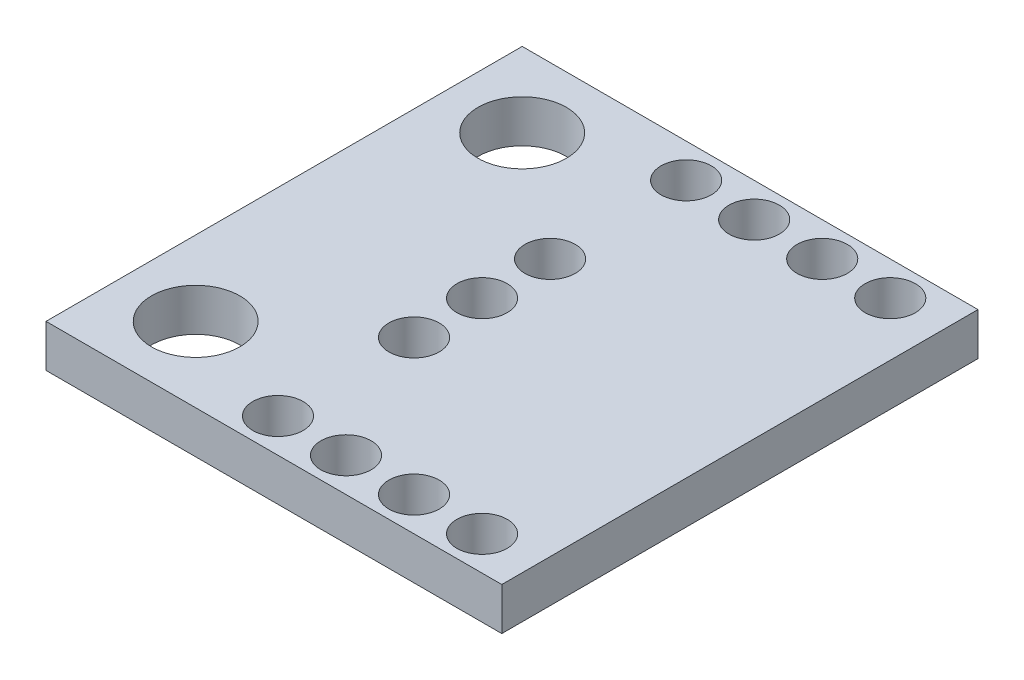
ISO-10303-21;
HEADER;
FILE_DESCRIPTION(('STEP AP214'),'2;1');
FILE_NAME('part.step','',(''),(''),'','','');
FILE_SCHEMA(('AUTOMOTIVE_DESIGN { 1 0 10303 214 1 1 1 1 }'));
ENDSEC;
DATA;
#1=APPLICATION_CONTEXT('core data for automotive mechanical design processes');
#2=APPLICATION_PROTOCOL_DEFINITION('international standard','automotive_design',2000,#1);
#3=PRODUCT_CONTEXT('',#1,'mechanical');
#4=PRODUCT('Part','Part','',(#3));
#5=PRODUCT_RELATED_PRODUCT_CATEGORY('part','',(#4));
#6=PRODUCT_DEFINITION_FORMATION('','',#4);
#7=PRODUCT_DEFINITION_CONTEXT('part definition',#1,'design');
#8=PRODUCT_DEFINITION('design','',#6,#7);
#9=PRODUCT_DEFINITION_SHAPE('','',#8);
#10=(LENGTH_UNIT() NAMED_UNIT(*) SI_UNIT(.MILLI.,.METRE.));
#11=(NAMED_UNIT(*) PLANE_ANGLE_UNIT() SI_UNIT($,.RADIAN.));
#12=(NAMED_UNIT(*) SI_UNIT($,.STERADIAN.) SOLID_ANGLE_UNIT());
#13=UNCERTAINTY_MEASURE_WITH_UNIT(LENGTH_MEASURE(1.E-05),#10,'distance_accuracy_value','');
#14=(GEOMETRIC_REPRESENTATION_CONTEXT(3) GLOBAL_UNCERTAINTY_ASSIGNED_CONTEXT((#13)) GLOBAL_UNIT_ASSIGNED_CONTEXT((#10,
#11,#12)) REPRESENTATION_CONTEXT('',''));
#15=CARTESIAN_POINT('',(0.,0.,0.));
#16=DIRECTION('',(0.,0.,1.));
#17=DIRECTION('',(1.,0.,0.));
#18=AXIS2_PLACEMENT_3D('',#15,#16,#17);
#19=CARTESIAN_POINT('',(0.,-2.2325,0.));
#20=DIRECTION('',(0.,-1.,0.));
#21=DIRECTION('',(0.,0.,-1.));
#22=AXIS2_PLACEMENT_3D('',#19,#20,#21);
#23=PLANE('',#22);
#24=DIRECTION('',(0.,0.,-1.));
#25=VECTOR('',#24,1.);
#26=CARTESIAN_POINT('',(8.50900000000003,-2.2325,71.4879559526874));
#27=LINE('',#26,#25);
#28=CARTESIAN_POINT('',(8.50900000000003,-2.2325,71.4879559526874));
#29=VERTEX_POINT('',#28);
#30=CARTESIAN_POINT('',(8.50900000000003,-2.2325,53.7079559526874));
#31=VERTEX_POINT('',#30);
#32=EDGE_CURVE('E85',#29,#31,#27,.T.);
#33=ORIENTED_EDGE('',*,*,#32,.T.);
#34=DIRECTION('',(-1.,0.,0.));
#35=VECTOR('',#34,1.);
#36=CARTESIAN_POINT('',(-8.50899999999998,-2.2325,53.7079559526874));
#37=LINE('',#36,#35);
#38=CARTESIAN_POINT('',(-8.50899999999998,-2.2325,53.7079559526874));
#39=VERTEX_POINT('',#38);
#40=EDGE_CURVE('E80',#31,#39,#37,.T.);
#41=ORIENTED_EDGE('',*,*,#40,.T.);
#42=DIRECTION('',(0.,0.,1.));
#43=VECTOR('',#42,1.);
#44=CARTESIAN_POINT('',(-8.50899999999998,-2.2325,71.4879559526874));
#45=LINE('',#44,#43);
#46=CARTESIAN_POINT('',(-8.50899999999998,-2.2325,71.4879559526874));
#47=VERTEX_POINT('',#46);
#48=EDGE_CURVE('E83',#39,#47,#45,.T.);
#49=ORIENTED_EDGE('',*,*,#48,.T.);
#50=DIRECTION('',(1.,0.,0.));
#51=VECTOR('',#50,1.);
#52=CARTESIAN_POINT('',(-8.50899999999998,-2.2325,71.4879559526874));
#53=LINE('',#52,#51);
#54=EDGE_CURVE('E50',#47,#29,#53,.T.);
#55=ORIENTED_EDGE('',*,*,#54,.T.);
#56=EDGE_LOOP('',(#33,#41,#49,#55));
#57=FACE_BOUND('',#56,.T.);
#58=CARTESIAN_POINT('',(-5.71499999999998,-2.2325,68.6939559526874));
#59=DIRECTION('',(0.,1.,0.));
#60=DIRECTION('',(0.,0.,1.));
#61=AXIS2_PLACEMENT_3D('',#58,#59,#60);
#62=CIRCLE('',#61,1.65);
#63=CARTESIAN_POINT('',(-5.71499999999998,-2.2325,70.3439559526874));
#64=VERTEX_POINT('',#63);
#65=EDGE_CURVE('E100',#64,#64,#62,.T.);
#66=ORIENTED_EDGE('',*,*,#65,.F.);
#67=EDGE_LOOP('',(#66));
#68=FACE_BOUND('',#67,.T.);
#69=CARTESIAN_POINT('',(-5.71499999999998,-2.2325,56.5019559526874));
#70=DIRECTION('',(0.,1.,0.));
#71=DIRECTION('',(0.,0.,-1.));
#72=AXIS2_PLACEMENT_3D('',#69,#70,#71);
#73=CIRCLE('',#72,1.65);
#74=CARTESIAN_POINT('',(-5.71499999999998,-2.2325,54.8519559526874));
#75=VERTEX_POINT('',#74);
#76=EDGE_CURVE('E115',#75,#75,#73,.T.);
#77=ORIENTED_EDGE('',*,*,#76,.F.);
#78=EDGE_LOOP('',(#77));
#79=FACE_BOUND('',#78,.T.);
#80=CARTESIAN_POINT('',(6.50240000000002,-2.2325,70.2179559526874));
#81=DIRECTION('',(0.,1.,0.));
#82=DIRECTION('',(0.,0.,1.));
#83=AXIS2_PLACEMENT_3D('',#80,#81,#82);
#84=CIRCLE('',#83,0.939799999999997);
#85=CARTESIAN_POINT('',(6.50240000000002,-2.2325,71.1577559526874));
#86=VERTEX_POINT('',#85);
#87=EDGE_CURVE('E121',#86,#86,#84,.T.);
#88=ORIENTED_EDGE('',*,*,#87,.F.);
#89=EDGE_LOOP('',(#88));
#90=FACE_BOUND('',#89,.T.);
#91=CARTESIAN_POINT('',(3.96240000000002,-2.2325,70.2179559526874));
#92=DIRECTION('',(0.,1.,0.));
#93=DIRECTION('',(0.,0.,1.));
#94=AXIS2_PLACEMENT_3D('',#91,#92,#93);
#95=CIRCLE('',#94,0.939799999999995);
#96=CARTESIAN_POINT('',(3.96240000000002,-2.2325,71.1577559526874));
#97=VERTEX_POINT('',#96);
#98=EDGE_CURVE('E127',#97,#97,#95,.T.);
#99=ORIENTED_EDGE('',*,*,#98,.F.);
#100=EDGE_LOOP('',(#99));
#101=FACE_BOUND('',#100,.T.);
#102=CARTESIAN_POINT('',(1.42240000000002,-2.2325,70.2179559526874));
#103=DIRECTION('',(0.,1.,0.));
#104=DIRECTION('',(0.,0.,1.));
#105=AXIS2_PLACEMENT_3D('',#102,#103,#104);
#106=CIRCLE('',#105,0.939799999999995);
#107=CARTESIAN_POINT('',(1.42240000000002,-2.2325,71.1577559526874));
#108=VERTEX_POINT('',#107);
#109=EDGE_CURVE('E133',#108,#108,#106,.T.);
#110=ORIENTED_EDGE('',*,*,#109,.F.);
#111=EDGE_LOOP('',(#110));
#112=FACE_BOUND('',#111,.T.);
#113=CARTESIAN_POINT('',(-1.11759999999998,-2.2325,70.2179559526874));
#114=DIRECTION('',(0.,1.,0.));
#115=DIRECTION('',(0.,0.,1.));
#116=AXIS2_PLACEMENT_3D('',#113,#114,#115);
#117=CIRCLE('',#116,0.939799999999996);
#118=CARTESIAN_POINT('',(-1.11759999999998,-2.2325,71.1577559526874));
#119=VERTEX_POINT('',#118);
#120=EDGE_CURVE('E139',#119,#119,#117,.T.);
#121=ORIENTED_EDGE('',*,*,#120,.F.);
#122=EDGE_LOOP('',(#121));
#123=FACE_BOUND('',#122,.T.);
#124=CARTESIAN_POINT('',(-1.11759999999998,-2.2325,62.5979559526874));
#125=DIRECTION('',(0.,1.,0.));
#126=DIRECTION('',(0.,0.,1.));
#127=AXIS2_PLACEMENT_3D('',#124,#125,#126);
#128=CIRCLE('',#127,0.939799999999997);
#129=CARTESIAN_POINT('',(-1.11759999999998,-2.2325,63.5377559526874));
#130=VERTEX_POINT('',#129);
#131=EDGE_CURVE('E145',#130,#130,#128,.T.);
#132=ORIENTED_EDGE('',*,*,#131,.F.);
#133=EDGE_LOOP('',(#132));
#134=FACE_BOUND('',#133,.T.);
#135=CARTESIAN_POINT('',(-1.11759999999998,-2.2325,65.1379559526874));
#136=DIRECTION('',(0.,1.,0.));
#137=DIRECTION('',(0.,0.,1.));
#138=AXIS2_PLACEMENT_3D('',#135,#136,#137);
#139=CIRCLE('',#138,0.939799999999996);
#140=CARTESIAN_POINT('',(-1.11759999999998,-2.2325,66.0777559526874));
#141=VERTEX_POINT('',#140);
#142=EDGE_CURVE('E151',#141,#141,#139,.T.);
#143=ORIENTED_EDGE('',*,*,#142,.F.);
#144=EDGE_LOOP('',(#143));
#145=FACE_BOUND('',#144,.T.);
#146=CARTESIAN_POINT('',(-1.11759999999998,-2.2325,60.0579559526874));
#147=DIRECTION('',(0.,1.,0.));
#148=DIRECTION('',(0.,0.,-1.));
#149=AXIS2_PLACEMENT_3D('',#146,#147,#148);
#150=CIRCLE('',#149,0.939799999999996);
#151=CARTESIAN_POINT('',(-1.11759999999998,-2.2325,59.1181559526874));
#152=VERTEX_POINT('',#151);
#153=EDGE_CURVE('E157',#152,#152,#150,.T.);
#154=ORIENTED_EDGE('',*,*,#153,.F.);
#155=EDGE_LOOP('',(#154));
#156=FACE_BOUND('',#155,.T.);
#157=CARTESIAN_POINT('',(6.50240000000002,-2.2325,54.9779559526874));
#158=DIRECTION('',(0.,1.,0.));
#159=DIRECTION('',(0.,0.,-1.));
#160=AXIS2_PLACEMENT_3D('',#157,#158,#159);
#161=CIRCLE('',#160,0.939799999999997);
#162=CARTESIAN_POINT('',(6.50240000000002,-2.2325,54.0381559526874));
#163=VERTEX_POINT('',#162);
#164=EDGE_CURVE('E163',#163,#163,#161,.T.);
#165=ORIENTED_EDGE('',*,*,#164,.F.);
#166=EDGE_LOOP('',(#165));
#167=FACE_BOUND('',#166,.T.);
#168=CARTESIAN_POINT('',(3.96240000000002,-2.2325,54.9779559526874));
#169=DIRECTION('',(0.,1.,0.));
#170=DIRECTION('',(0.,0.,-1.));
#171=AXIS2_PLACEMENT_3D('',#168,#169,#170);
#172=CIRCLE('',#171,0.939799999999995);
#173=CARTESIAN_POINT('',(3.96240000000002,-2.2325,54.0381559526874));
#174=VERTEX_POINT('',#173);
#175=EDGE_CURVE('E169',#174,#174,#172,.T.);
#176=ORIENTED_EDGE('',*,*,#175,.F.);
#177=EDGE_LOOP('',(#176));
#178=FACE_BOUND('',#177,.T.);
#179=CARTESIAN_POINT('',(1.42240000000002,-2.2325,54.9779559526874));
#180=DIRECTION('',(0.,1.,0.));
#181=DIRECTION('',(0.,0.,-1.));
#182=AXIS2_PLACEMENT_3D('',#179,#180,#181);
#183=CIRCLE('',#182,0.939799999999995);
#184=CARTESIAN_POINT('',(1.42240000000002,-2.2325,54.0381559526874));
#185=VERTEX_POINT('',#184);
#186=EDGE_CURVE('E175',#185,#185,#183,.T.);
#187=ORIENTED_EDGE('',*,*,#186,.F.);
#188=EDGE_LOOP('',(#187));
#189=FACE_BOUND('',#188,.T.);
#190=CARTESIAN_POINT('',(-1.11759999999998,-2.2325,54.9779559526874));
#191=DIRECTION('',(0.,1.,0.));
#192=DIRECTION('',(0.,0.,-1.));
#193=AXIS2_PLACEMENT_3D('',#190,#191,#192);
#194=CIRCLE('',#193,0.939799999999996);
#195=CARTESIAN_POINT('',(-1.11759999999998,-2.2325,54.0381559526874));
#196=VERTEX_POINT('',#195);
#197=EDGE_CURVE('E181',#196,#196,#194,.T.);
#198=ORIENTED_EDGE('',*,*,#197,.F.);
#199=EDGE_LOOP('',(#198));
#200=FACE_BOUND('',#199,.T.);
#201=ADVANCED_FACE('F33',(#57,#68,#79,#90,#101,#112,#123,#134,#145,#156,#167,#178,#189,#200),
#23,.F.);
#202=CARTESIAN_POINT('',(0.,-3.82,0.));
#203=DIRECTION('',(0.,-1.,0.));
#204=DIRECTION('',(0.,0.,-1.));
#205=AXIS2_PLACEMENT_3D('',#202,#203,#204);
#206=PLANE('',#205);
#207=CARTESIAN_POINT('',(1.42240000000002,-3.82,54.9779559526874));
#208=DIRECTION('',(0.,1.,0.));
#209=DIRECTION('',(0.,0.,-1.));
#210=AXIS2_PLACEMENT_3D('',#207,#208,#209);
#211=CIRCLE('',#210,0.939799999999995);
#212=CARTESIAN_POINT('',(1.42240000000002,-3.82,54.0381559526874));
#213=VERTEX_POINT('',#212);
#214=EDGE_CURVE('E178',#213,#213,#211,.T.);
#215=ORIENTED_EDGE('',*,*,#214,.T.);
#216=EDGE_LOOP('',(#215));
#217=FACE_BOUND('',#216,.T.);
#218=CARTESIAN_POINT('',(6.50240000000002,-3.82,54.9779559526874));
#219=DIRECTION('',(0.,1.,0.));
#220=DIRECTION('',(0.,0.,-1.));
#221=AXIS2_PLACEMENT_3D('',#218,#219,#220);
#222=CIRCLE('',#221,0.939799999999997);
#223=CARTESIAN_POINT('',(6.50240000000002,-3.82,54.0381559526874));
#224=VERTEX_POINT('',#223);
#225=EDGE_CURVE('E166',#224,#224,#222,.T.);
#226=ORIENTED_EDGE('',*,*,#225,.T.);
#227=EDGE_LOOP('',(#226));
#228=FACE_BOUND('',#227,.T.);
#229=CARTESIAN_POINT('',(-1.11759999999998,-3.82,65.1379559526874));
#230=DIRECTION('',(0.,1.,0.));
#231=DIRECTION('',(0.,0.,1.));
#232=AXIS2_PLACEMENT_3D('',#229,#230,#231);
#233=CIRCLE('',#232,0.939799999999996);
#234=CARTESIAN_POINT('',(-1.11759999999998,-3.82,66.0777559526874));
#235=VERTEX_POINT('',#234);
#236=EDGE_CURVE('E154',#235,#235,#233,.T.);
#237=ORIENTED_EDGE('',*,*,#236,.T.);
#238=EDGE_LOOP('',(#237));
#239=FACE_BOUND('',#238,.T.);
#240=CARTESIAN_POINT('',(-1.11759999999998,-3.82,70.2179559526874));
#241=DIRECTION('',(0.,1.,0.));
#242=DIRECTION('',(0.,0.,1.));
#243=AXIS2_PLACEMENT_3D('',#240,#241,#242);
#244=CIRCLE('',#243,0.939799999999996);
#245=CARTESIAN_POINT('',(-1.11759999999998,-3.82,71.1577559526874));
#246=VERTEX_POINT('',#245);
#247=EDGE_CURVE('E142',#246,#246,#244,.T.);
#248=ORIENTED_EDGE('',*,*,#247,.T.);
#249=EDGE_LOOP('',(#248));
#250=FACE_BOUND('',#249,.T.);
#251=CARTESIAN_POINT('',(3.96240000000002,-3.82,70.2179559526874));
#252=DIRECTION('',(0.,1.,0.));
#253=DIRECTION('',(0.,0.,1.));
#254=AXIS2_PLACEMENT_3D('',#251,#252,#253);
#255=CIRCLE('',#254,0.939799999999995);
#256=CARTESIAN_POINT('',(3.96240000000002,-3.82,71.1577559526874));
#257=VERTEX_POINT('',#256);
#258=EDGE_CURVE('E130',#257,#257,#255,.T.);
#259=ORIENTED_EDGE('',*,*,#258,.T.);
#260=EDGE_LOOP('',(#259));
#261=FACE_BOUND('',#260,.T.);
#262=CARTESIAN_POINT('',(-5.71499999999998,-3.82,56.5019559526874));
#263=DIRECTION('',(0.,1.,0.));
#264=DIRECTION('',(0.,0.,-1.));
#265=AXIS2_PLACEMENT_3D('',#262,#263,#264);
#266=CIRCLE('',#265,1.65);
#267=CARTESIAN_POINT('',(-5.71499999999998,-3.82,54.8519559526874));
#268=VERTEX_POINT('',#267);
#269=EDGE_CURVE('E118',#268,#268,#266,.T.);
#270=ORIENTED_EDGE('',*,*,#269,.T.);
#271=EDGE_LOOP('',(#270));
#272=FACE_BOUND('',#271,.T.);
#273=DIRECTION('',(0.,0.,-1.));
#274=VECTOR('',#273,1.);
#275=CARTESIAN_POINT('',(8.50900000000003,-3.82,71.4879559526874));
#276=LINE('',#275,#274);
#277=CARTESIAN_POINT('',(8.50900000000003,-3.82,71.4879559526874));
#278=VERTEX_POINT('',#277);
#279=CARTESIAN_POINT('',(8.50900000000003,-3.82,53.7079559526874));
#280=VERTEX_POINT('',#279);
#281=EDGE_CURVE('E97',#278,#280,#276,.T.);
#282=ORIENTED_EDGE('',*,*,#281,.F.);
#283=DIRECTION('',(1.,0.,0.));
#284=VECTOR('',#283,1.);
#285=CARTESIAN_POINT('',(-8.50899999999998,-3.82,71.4879559526874));
#286=LINE('',#285,#284);
#287=CARTESIAN_POINT('',(-8.50899999999998,-3.82,71.4879559526874));
#288=VERTEX_POINT('',#287);
#289=EDGE_CURVE('E73',#288,#278,#286,.T.);
#290=ORIENTED_EDGE('',*,*,#289,.F.);
#291=DIRECTION('',(0.,0.,1.));
#292=VECTOR('',#291,1.);
#293=CARTESIAN_POINT('',(-8.50899999999998,-3.82,71.4879559526874));
#294=LINE('',#293,#292);
#295=CARTESIAN_POINT('',(-8.50899999999998,-3.82,53.7079559526874));
#296=VERTEX_POINT('',#295);
#297=EDGE_CURVE('E67',#296,#288,#294,.T.);
#298=ORIENTED_EDGE('',*,*,#297,.F.);
#299=DIRECTION('',(-1.,0.,0.));
#300=VECTOR('',#299,1.);
#301=CARTESIAN_POINT('',(-8.50899999999998,-3.82,53.7079559526874));
#302=LINE('',#301,#300);
#303=EDGE_CURVE('E89',#280,#296,#302,.T.);
#304=ORIENTED_EDGE('',*,*,#303,.F.);
#305=EDGE_LOOP('',(#282,#290,#298,#304));
#306=FACE_BOUND('',#305,.T.);
#307=CARTESIAN_POINT('',(-5.71499999999998,-3.82,68.6939559526874));
#308=DIRECTION('',(0.,1.,0.));
#309=DIRECTION('',(0.,0.,1.));
#310=AXIS2_PLACEMENT_3D('',#307,#308,#309);
#311=CIRCLE('',#310,1.65);
#312=CARTESIAN_POINT('',(-5.71499999999998,-3.82,70.3439559526874));
#313=VERTEX_POINT('',#312);
#314=EDGE_CURVE('E112',#313,#313,#311,.T.);
#315=ORIENTED_EDGE('',*,*,#314,.T.);
#316=EDGE_LOOP('',(#315));
#317=FACE_BOUND('',#316,.T.);
#318=CARTESIAN_POINT('',(6.50240000000002,-3.82,70.2179559526874));
#319=DIRECTION('',(0.,1.,0.));
#320=DIRECTION('',(0.,0.,1.));
#321=AXIS2_PLACEMENT_3D('',#318,#319,#320);
#322=CIRCLE('',#321,0.939799999999997);
#323=CARTESIAN_POINT('',(6.50240000000002,-3.82,71.1577559526874));
#324=VERTEX_POINT('',#323);
#325=EDGE_CURVE('E124',#324,#324,#322,.T.);
#326=ORIENTED_EDGE('',*,*,#325,.T.);
#327=EDGE_LOOP('',(#326));
#328=FACE_BOUND('',#327,.T.);
#329=CARTESIAN_POINT('',(1.42240000000002,-3.82,70.2179559526874));
#330=DIRECTION('',(0.,1.,0.));
#331=DIRECTION('',(0.,0.,1.));
#332=AXIS2_PLACEMENT_3D('',#329,#330,#331);
#333=CIRCLE('',#332,0.939799999999995);
#334=CARTESIAN_POINT('',(1.42240000000002,-3.82,71.1577559526874));
#335=VERTEX_POINT('',#334);
#336=EDGE_CURVE('E136',#335,#335,#333,.T.);
#337=ORIENTED_EDGE('',*,*,#336,.T.);
#338=EDGE_LOOP('',(#337));
#339=FACE_BOUND('',#338,.T.);
#340=CARTESIAN_POINT('',(-1.11759999999998,-3.82,62.5979559526874));
#341=DIRECTION('',(0.,1.,0.));
#342=DIRECTION('',(0.,0.,1.));
#343=AXIS2_PLACEMENT_3D('',#340,#341,#342);
#344=CIRCLE('',#343,0.939799999999997);
#345=CARTESIAN_POINT('',(-1.11759999999998,-3.82,63.5377559526874));
#346=VERTEX_POINT('',#345);
#347=EDGE_CURVE('E148',#346,#346,#344,.T.);
#348=ORIENTED_EDGE('',*,*,#347,.T.);
#349=EDGE_LOOP('',(#348));
#350=FACE_BOUND('',#349,.T.);
#351=CARTESIAN_POINT('',(-1.11759999999998,-3.82,60.0579559526874));
#352=DIRECTION('',(0.,1.,0.));
#353=DIRECTION('',(0.,0.,-1.));
#354=AXIS2_PLACEMENT_3D('',#351,#352,#353);
#355=CIRCLE('',#354,0.939799999999996);
#356=CARTESIAN_POINT('',(-1.11759999999998,-3.82,59.1181559526874));
#357=VERTEX_POINT('',#356);
#358=EDGE_CURVE('E160',#357,#357,#355,.T.);
#359=ORIENTED_EDGE('',*,*,#358,.T.);
#360=EDGE_LOOP('',(#359));
#361=FACE_BOUND('',#360,.T.);
#362=CARTESIAN_POINT('',(3.96240000000002,-3.82,54.9779559526874));
#363=DIRECTION('',(0.,1.,0.));
#364=DIRECTION('',(0.,0.,-1.));
#365=AXIS2_PLACEMENT_3D('',#362,#363,#364);
#366=CIRCLE('',#365,0.939799999999995);
#367=CARTESIAN_POINT('',(3.96240000000002,-3.82,54.0381559526874));
#368=VERTEX_POINT('',#367);
#369=EDGE_CURVE('E172',#368,#368,#366,.T.);
#370=ORIENTED_EDGE('',*,*,#369,.T.);
#371=EDGE_LOOP('',(#370));
#372=FACE_BOUND('',#371,.T.);
#373=CARTESIAN_POINT('',(-1.11759999999998,-3.82,54.9779559526874));
#374=DIRECTION('',(0.,1.,0.));
#375=DIRECTION('',(0.,0.,-1.));
#376=AXIS2_PLACEMENT_3D('',#373,#374,#375);
#377=CIRCLE('',#376,0.939799999999996);
#378=CARTESIAN_POINT('',(-1.11759999999998,-3.82,54.0381559526874));
#379=VERTEX_POINT('',#378);
#380=EDGE_CURVE('E184',#379,#379,#377,.T.);
#381=ORIENTED_EDGE('',*,*,#380,.T.);
#382=EDGE_LOOP('',(#381));
#383=FACE_BOUND('',#382,.T.);
#384=ADVANCED_FACE('F108',(#217,#228,#239,#250,#261,#272,#306,#317,#328,#339,#350,#361,#372,
#383),#206,.T.);
#385=CARTESIAN_POINT('',(8.50900000000003,-2.2325,71.4879559526874));
#386=DIRECTION('',(-1.,0.,0.));
#387=DIRECTION('',(0.,0.,1.));
#388=AXIS2_PLACEMENT_3D('',#385,#386,#387);
#389=PLANE('',#388);
#390=ORIENTED_EDGE('',*,*,#281,.T.);
#391=DIRECTION('',(0.,-1.,0.));
#392=VECTOR('',#391,1.);
#393=CARTESIAN_POINT('',(8.50900000000003,-2.2325,53.7079559526874));
#394=LINE('',#393,#392);
#395=EDGE_CURVE('E11',#31,#280,#394,.T.);
#396=ORIENTED_EDGE('',*,*,#395,.F.);
#397=ORIENTED_EDGE('',*,*,#32,.F.);
#398=DIRECTION('',(0.,-1.,0.));
#399=VECTOR('',#398,1.);
#400=CARTESIAN_POINT('',(8.50900000000003,-2.2325,71.4879559526874));
#401=LINE('',#400,#399);
#402=EDGE_CURVE('E93',#29,#278,#401,.T.);
#403=ORIENTED_EDGE('',*,*,#402,.T.);
#404=EDGE_LOOP('',(#390,#396,#397,#403));
#405=FACE_BOUND('',#404,.T.);
#406=ADVANCED_FACE('F35',(#405),#389,.F.);
#407=CARTESIAN_POINT('',(-8.50899999999998,-2.2325,53.7079559526874));
#408=DIRECTION('',(0.,0.,1.));
#409=DIRECTION('',(1.,0.,0.));
#410=AXIS2_PLACEMENT_3D('',#407,#408,#409);
#411=PLANE('',#410);
#412=ORIENTED_EDGE('',*,*,#303,.T.);
#413=DIRECTION('',(0.,-1.,0.));
#414=VECTOR('',#413,1.);
#415=CARTESIAN_POINT('',(-8.50899999999998,-2.2325,53.7079559526874));
#416=LINE('',#415,#414);
#417=EDGE_CURVE('E42',#39,#296,#416,.T.);
#418=ORIENTED_EDGE('',*,*,#417,.F.);
#419=ORIENTED_EDGE('',*,*,#40,.F.);
#420=ORIENTED_EDGE('',*,*,#395,.T.);
#421=EDGE_LOOP('',(#412,#418,#419,#420));
#422=FACE_BOUND('',#421,.T.);
#423=ADVANCED_FACE('F88',(#422),#411,.F.);
#424=CARTESIAN_POINT('',(-8.50899999999998,-2.2325,71.4879559526874));
#425=DIRECTION('',(1.,0.,0.));
#426=DIRECTION('',(0.,0.,-1.));
#427=AXIS2_PLACEMENT_3D('',#424,#425,#426);
#428=PLANE('',#427);
#429=ORIENTED_EDGE('',*,*,#297,.T.);
#430=DIRECTION('',(0.,-1.,0.));
#431=VECTOR('',#430,1.);
#432=CARTESIAN_POINT('',(-8.50899999999998,-2.2325,71.4879559526874));
#433=LINE('',#432,#431);
#434=EDGE_CURVE('E90',#47,#288,#433,.T.);
#435=ORIENTED_EDGE('',*,*,#434,.F.);
#436=ORIENTED_EDGE('',*,*,#48,.F.);
#437=ORIENTED_EDGE('',*,*,#417,.T.);
#438=EDGE_LOOP('',(#429,#435,#436,#437));
#439=FACE_BOUND('',#438,.T.);
#440=ADVANCED_FACE('F91',(#439),#428,.F.);
#441=CARTESIAN_POINT('',(-8.50899999999998,-2.2325,71.4879559526874));
#442=DIRECTION('',(0.,0.,-1.));
#443=DIRECTION('',(-1.,0.,0.));
#444=AXIS2_PLACEMENT_3D('',#441,#442,#443);
#445=PLANE('',#444);
#446=ORIENTED_EDGE('',*,*,#289,.T.);
#447=ORIENTED_EDGE('',*,*,#402,.F.);
#448=ORIENTED_EDGE('',*,*,#54,.F.);
#449=ORIENTED_EDGE('',*,*,#434,.T.);
#450=EDGE_LOOP('',(#446,#447,#448,#449));
#451=FACE_BOUND('',#450,.T.);
#452=ADVANCED_FACE('F105',(#451),#445,.F.);
#453=CARTESIAN_POINT('',(-5.71499999999998,-2.2325,68.6939559526874));
#454=DIRECTION('',(0.,-1.,0.));
#455=DIRECTION('',(0.,0.,-1.));
#456=AXIS2_PLACEMENT_3D('',#453,#454,#455);
#457=CYLINDRICAL_SURFACE('',#456,1.65);
#458=ORIENTED_EDGE('',*,*,#65,.T.);
#459=EDGE_LOOP('',(#458));
#460=FACE_BOUND('',#459,.T.);
#461=ORIENTED_EDGE('',*,*,#314,.F.);
#462=EDGE_LOOP('',(#461));
#463=FACE_BOUND('',#462,.T.);
#464=ADVANCED_FACE('F201',(#460,#463),#457,.F.);
#465=CARTESIAN_POINT('',(-5.71499999999998,-2.2325,56.5019559526874));
#466=DIRECTION('',(0.,-1.,0.));
#467=DIRECTION('',(0.,0.,-1.));
#468=AXIS2_PLACEMENT_3D('',#465,#466,#467);
#469=CYLINDRICAL_SURFACE('',#468,1.65);
#470=ORIENTED_EDGE('',*,*,#76,.T.);
#471=EDGE_LOOP('',(#470));
#472=FACE_BOUND('',#471,.T.);
#473=ORIENTED_EDGE('',*,*,#269,.F.);
#474=EDGE_LOOP('',(#473));
#475=FACE_BOUND('',#474,.T.);
#476=ADVANCED_FACE('F247',(#472,#475),#469,.F.);
#477=CARTESIAN_POINT('',(6.50240000000002,-2.2325,70.2179559526874));
#478=DIRECTION('',(0.,-1.,0.));
#479=DIRECTION('',(0.,0.,-1.));
#480=AXIS2_PLACEMENT_3D('',#477,#478,#479);
#481=CYLINDRICAL_SURFACE('',#480,0.939799999999997);
#482=ORIENTED_EDGE('',*,*,#87,.T.);
#483=EDGE_LOOP('',(#482));
#484=FACE_BOUND('',#483,.T.);
#485=ORIENTED_EDGE('',*,*,#325,.F.);
#486=EDGE_LOOP('',(#485));
#487=FACE_BOUND('',#486,.T.);
#488=ADVANCED_FACE('F255',(#484,#487),#481,.F.);
#489=CARTESIAN_POINT('',(3.96240000000002,-2.2325,70.2179559526874));
#490=DIRECTION('',(0.,-1.,0.));
#491=DIRECTION('',(0.,0.,-1.));
#492=AXIS2_PLACEMENT_3D('',#489,#490,#491);
#493=CYLINDRICAL_SURFACE('',#492,0.939799999999995);
#494=ORIENTED_EDGE('',*,*,#98,.T.);
#495=EDGE_LOOP('',(#494));
#496=FACE_BOUND('',#495,.T.);
#497=ORIENTED_EDGE('',*,*,#258,.F.);
#498=EDGE_LOOP('',(#497));
#499=FACE_BOUND('',#498,.T.);
#500=ADVANCED_FACE('F263',(#496,#499),#493,.F.);
#501=CARTESIAN_POINT('',(1.42240000000002,-2.2325,70.2179559526874));
#502=DIRECTION('',(0.,-1.,0.));
#503=DIRECTION('',(0.,0.,-1.));
#504=AXIS2_PLACEMENT_3D('',#501,#502,#503);
#505=CYLINDRICAL_SURFACE('',#504,0.939799999999995);
#506=ORIENTED_EDGE('',*,*,#109,.T.);
#507=EDGE_LOOP('',(#506));
#508=FACE_BOUND('',#507,.T.);
#509=ORIENTED_EDGE('',*,*,#336,.F.);
#510=EDGE_LOOP('',(#509));
#511=FACE_BOUND('',#510,.T.);
#512=ADVANCED_FACE('F272',(#508,#511),#505,.F.);
#513=CARTESIAN_POINT('',(-1.11759999999998,-2.2325,70.2179559526874));
#514=DIRECTION('',(0.,-1.,0.));
#515=DIRECTION('',(0.,0.,-1.));
#516=AXIS2_PLACEMENT_3D('',#513,#514,#515);
#517=CYLINDRICAL_SURFACE('',#516,0.939799999999996);
#518=ORIENTED_EDGE('',*,*,#120,.T.);
#519=EDGE_LOOP('',(#518));
#520=FACE_BOUND('',#519,.T.);
#521=ORIENTED_EDGE('',*,*,#247,.F.);
#522=EDGE_LOOP('',(#521));
#523=FACE_BOUND('',#522,.T.);
#524=ADVANCED_FACE('F281',(#520,#523),#517,.F.);
#525=CARTESIAN_POINT('',(-1.11759999999998,-2.2325,62.5979559526874));
#526=DIRECTION('',(0.,-1.,0.));
#527=DIRECTION('',(0.,0.,-1.));
#528=AXIS2_PLACEMENT_3D('',#525,#526,#527);
#529=CYLINDRICAL_SURFACE('',#528,0.939799999999997);
#530=ORIENTED_EDGE('',*,*,#131,.T.);
#531=EDGE_LOOP('',(#530));
#532=FACE_BOUND('',#531,.T.);
#533=ORIENTED_EDGE('',*,*,#347,.F.);
#534=EDGE_LOOP('',(#533));
#535=FACE_BOUND('',#534,.T.);
#536=ADVANCED_FACE('F290',(#532,#535),#529,.F.);
#537=CARTESIAN_POINT('',(-1.11759999999998,-2.2325,65.1379559526874));
#538=DIRECTION('',(0.,-1.,0.));
#539=DIRECTION('',(0.,0.,-1.));
#540=AXIS2_PLACEMENT_3D('',#537,#538,#539);
#541=CYLINDRICAL_SURFACE('',#540,0.939799999999996);
#542=ORIENTED_EDGE('',*,*,#142,.T.);
#543=EDGE_LOOP('',(#542));
#544=FACE_BOUND('',#543,.T.);
#545=ORIENTED_EDGE('',*,*,#236,.F.);
#546=EDGE_LOOP('',(#545));
#547=FACE_BOUND('',#546,.T.);
#548=ADVANCED_FACE('F299',(#544,#547),#541,.F.);
#549=CARTESIAN_POINT('',(-1.11759999999998,-2.2325,60.0579559526874));
#550=DIRECTION('',(0.,-1.,0.));
#551=DIRECTION('',(0.,0.,-1.));
#552=AXIS2_PLACEMENT_3D('',#549,#550,#551);
#553=CYLINDRICAL_SURFACE('',#552,0.939799999999996);
#554=ORIENTED_EDGE('',*,*,#153,.T.);
#555=EDGE_LOOP('',(#554));
#556=FACE_BOUND('',#555,.T.);
#557=ORIENTED_EDGE('',*,*,#358,.F.);
#558=EDGE_LOOP('',(#557));
#559=FACE_BOUND('',#558,.T.);
#560=ADVANCED_FACE('F308',(#556,#559),#553,.F.);
#561=CARTESIAN_POINT('',(6.50240000000002,-2.2325,54.9779559526874));
#562=DIRECTION('',(0.,-1.,0.));
#563=DIRECTION('',(0.,0.,-1.));
#564=AXIS2_PLACEMENT_3D('',#561,#562,#563);
#565=CYLINDRICAL_SURFACE('',#564,0.939799999999997);
#566=ORIENTED_EDGE('',*,*,#164,.T.);
#567=EDGE_LOOP('',(#566));
#568=FACE_BOUND('',#567,.T.);
#569=ORIENTED_EDGE('',*,*,#225,.F.);
#570=EDGE_LOOP('',(#569));
#571=FACE_BOUND('',#570,.T.);
#572=ADVANCED_FACE('F317',(#568,#571),#565,.F.);
#573=CARTESIAN_POINT('',(3.96240000000002,-2.2325,54.9779559526874));
#574=DIRECTION('',(0.,-1.,0.));
#575=DIRECTION('',(0.,0.,-1.));
#576=AXIS2_PLACEMENT_3D('',#573,#574,#575);
#577=CYLINDRICAL_SURFACE('',#576,0.939799999999995);
#578=ORIENTED_EDGE('',*,*,#175,.T.);
#579=EDGE_LOOP('',(#578));
#580=FACE_BOUND('',#579,.T.);
#581=ORIENTED_EDGE('',*,*,#369,.F.);
#582=EDGE_LOOP('',(#581));
#583=FACE_BOUND('',#582,.T.);
#584=ADVANCED_FACE('F326',(#580,#583),#577,.F.);
#585=CARTESIAN_POINT('',(1.42240000000002,-2.2325,54.9779559526874));
#586=DIRECTION('',(0.,-1.,0.));
#587=DIRECTION('',(0.,0.,-1.));
#588=AXIS2_PLACEMENT_3D('',#585,#586,#587);
#589=CYLINDRICAL_SURFACE('',#588,0.939799999999995);
#590=ORIENTED_EDGE('',*,*,#186,.T.);
#591=EDGE_LOOP('',(#590));
#592=FACE_BOUND('',#591,.T.);
#593=ORIENTED_EDGE('',*,*,#214,.F.);
#594=EDGE_LOOP('',(#593));
#595=FACE_BOUND('',#594,.T.);
#596=ADVANCED_FACE('F335',(#592,#595),#589,.F.);
#597=CARTESIAN_POINT('',(-1.11759999999998,-2.2325,54.9779559526874));
#598=DIRECTION('',(0.,-1.,0.));
#599=DIRECTION('',(0.,0.,-1.));
#600=AXIS2_PLACEMENT_3D('',#597,#598,#599);
#601=CYLINDRICAL_SURFACE('',#600,0.939799999999996);
#602=ORIENTED_EDGE('',*,*,#197,.T.);
#603=EDGE_LOOP('',(#602));
#604=FACE_BOUND('',#603,.T.);
#605=ORIENTED_EDGE('',*,*,#380,.F.);
#606=EDGE_LOOP('',(#605));
#607=FACE_BOUND('',#606,.T.);
#608=ADVANCED_FACE('F190',(#604,#607),#601,.F.);
#609=CLOSED_SHELL('',(#201,#384,#406,#423,#440,#452,#464,#476,#488,#500,#512,#524,#536,#548,
#560,#572,#584,#596,#608));
#610=MANIFOLD_SOLID_BREP('B2',#609);
#611=ADVANCED_BREP_SHAPE_REPRESENTATION('',(#18,#610),#14);
#612=SHAPE_DEFINITION_REPRESENTATION(#9,#611);
ENDSEC;
END-ISO-10303-21;
